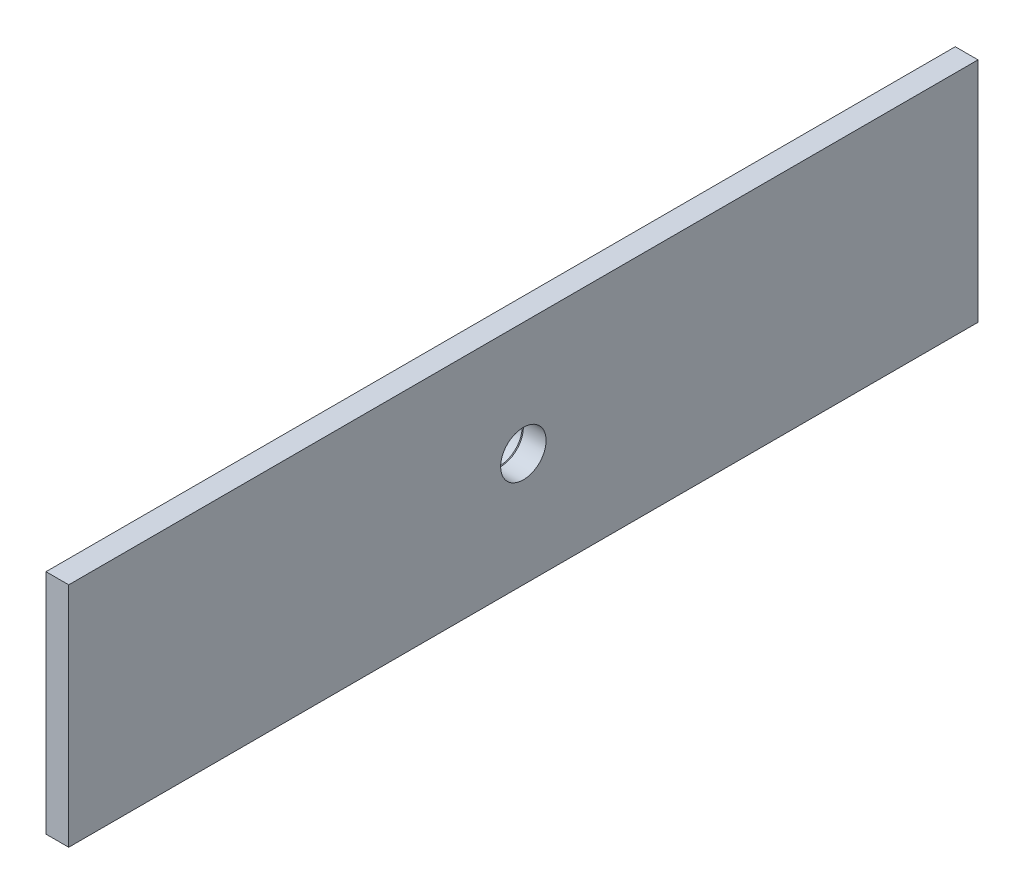
ISO-10303-21;
HEADER;
FILE_DESCRIPTION(('STEP AP214'),'2;1');
FILE_NAME('part.step','',(''),(''),'','','');
FILE_SCHEMA(('AUTOMOTIVE_DESIGN { 1 0 10303 214 1 1 1 1 }'));
ENDSEC;
DATA;
#1=APPLICATION_CONTEXT('core data for automotive mechanical design processes');
#2=APPLICATION_PROTOCOL_DEFINITION('international standard','automotive_design',2000,#1);
#3=PRODUCT_CONTEXT('',#1,'mechanical');
#4=PRODUCT('Part','Part','',(#3));
#5=PRODUCT_RELATED_PRODUCT_CATEGORY('part','',(#4));
#6=PRODUCT_DEFINITION_FORMATION('','',#4);
#7=PRODUCT_DEFINITION_CONTEXT('part definition',#1,'design');
#8=PRODUCT_DEFINITION('design','',#6,#7);
#9=PRODUCT_DEFINITION_SHAPE('','',#8);
#10=(LENGTH_UNIT() NAMED_UNIT(*) SI_UNIT(.MILLI.,.METRE.));
#11=(NAMED_UNIT(*) PLANE_ANGLE_UNIT() SI_UNIT($,.RADIAN.));
#12=(NAMED_UNIT(*) SI_UNIT($,.STERADIAN.) SOLID_ANGLE_UNIT());
#13=UNCERTAINTY_MEASURE_WITH_UNIT(LENGTH_MEASURE(1.E-05),#10,'distance_accuracy_value','');
#14=(GEOMETRIC_REPRESENTATION_CONTEXT(3) GLOBAL_UNCERTAINTY_ASSIGNED_CONTEXT((#13)) GLOBAL_UNIT_ASSIGNED_CONTEXT((#10,
#11,#12)) REPRESENTATION_CONTEXT('',''));
#15=CARTESIAN_POINT('',(0.,0.,0.));
#16=DIRECTION('',(0.,0.,1.));
#17=DIRECTION('',(1.,0.,0.));
#18=AXIS2_PLACEMENT_3D('',#15,#16,#17);
#19=CARTESIAN_POINT('',(528.,0.,889.100000000003));
#20=DIRECTION('',(1.,0.,0.));
#21=DIRECTION('',(0.,1.,0.));
#22=AXIS2_PLACEMENT_3D('',#19,#20,#21);
#23=CYLINDRICAL_SURFACE('',#22,20.);
#24=CARTESIAN_POINT('',(532.133974596216,0.,889.100000000003));
#25=DIRECTION('',(1.,0.,0.));
#26=DIRECTION('',(0.,1.,0.));
#27=AXIS2_PLACEMENT_3D('',#24,#25,#26);
#28=CIRCLE('',#27,20.);
#29=CARTESIAN_POINT('',(532.133974596216,19.9999999999999,889.100000000003));
#30=VERTEX_POINT('',#29);
#31=EDGE_CURVE('P0_E238',#30,#30,#28,.F.);
#32=ORIENTED_EDGE('',*,*,#31,.T.);
#33=EDGE_LOOP('',(#32));
#34=FACE_BOUND('',#33,.T.);
#35=CARTESIAN_POINT('',(528.5,0.,889.1));
#36=DIRECTION('',(1.,0.,0.));
#37=DIRECTION('',(0.,0.,-1.));
#38=AXIS2_PLACEMENT_3D('',#35,#36,#37);
#39=CIRCLE('',#38,20.);
#40=CARTESIAN_POINT('',(528.5,-0.499999999999685,909.093749023132));
#41=VERTEX_POINT('',#40);
#42=CARTESIAN_POINT('',(528.5,0.500000000000318,909.093749023132));
#43=VERTEX_POINT('',#42);
#44=EDGE_CURVE('P0_E190',#41,#43,#39,.F.);
#45=ORIENTED_EDGE('',*,*,#44,.T.);
#46=DIRECTION('',(1.,0.,0.));
#47=VECTOR('',#46,1.);
#48=CARTESIAN_POINT('',(532.84565955403,0.500000000000321,909.093749023132));
#49=LINE('',#48,#47);
#50=CARTESIAN_POINT('',(530.5,0.500000000000315,909.093749023135));
#51=VERTEX_POINT('',#50);
#52=EDGE_CURVE('P0_E216',#43,#51,#49,.T.);
#53=ORIENTED_EDGE('',*,*,#52,.T.);
#54=CARTESIAN_POINT('',(530.5,0.,889.1));
#55=DIRECTION('',(1.,0.,0.));
#56=DIRECTION('',(0.,0.,-1.));
#57=AXIS2_PLACEMENT_3D('',#54,#55,#56);
#58=CIRCLE('',#57,20.);
#59=CARTESIAN_POINT('',(530.5,-0.499999999999682,909.093749023132));
#60=VERTEX_POINT('',#59);
#61=EDGE_CURVE('P0_E60',#51,#60,#58,.T.);
#62=ORIENTED_EDGE('',*,*,#61,.T.);
#63=DIRECTION('',(1.,0.,0.));
#64=VECTOR('',#63,1.);
#65=CARTESIAN_POINT('',(532.84565955403,-0.499999999999683,909.093749023132));
#66=LINE('',#65,#64);
#67=EDGE_CURVE('P0_E208',#60,#41,#66,.F.);
#68=ORIENTED_EDGE('',*,*,#67,.T.);
#69=EDGE_LOOP('',(#45,#53,#62,#68));
#70=FACE_BOUND('',#69,.T.);
#71=CARTESIAN_POINT('',(528.,0.,889.100000000003));
#72=DIRECTION('',(1.,0.,0.));
#73=DIRECTION('',(0.,1.,0.));
#74=AXIS2_PLACEMENT_3D('',#71,#72,#73);
#75=CIRCLE('',#74,20.);
#76=CARTESIAN_POINT('',(528.,19.9999999999999,889.100000000003));
#77=VERTEX_POINT('',#76);
#78=EDGE_CURVE('P0_E195',#77,#77,#75,.T.);
#79=ORIENTED_EDGE('',*,*,#78,.T.);
#80=EDGE_LOOP('',(#79));
#81=FACE_BOUND('',#80,.T.);
#82=ADVANCED_FACE('P0_F43',(#34,#70,#81),#23,.T.);
#83=CARTESIAN_POINT('',(528.,19.9999999999999,889.100000000003));
#84=DIRECTION('',(-1.,0.,0.));
#85=DIRECTION('',(0.,-1.,0.));
#86=AXIS2_PLACEMENT_3D('',#83,#84,#85);
#87=PLANE('',#86);
#88=CARTESIAN_POINT('',(528.,11.1369318036882,900.236931803688));
#89=DIRECTION('',(-1.,0.,0.));
#90=DIRECTION('',(0.,0.,1.));
#91=AXIS2_PLACEMENT_3D('',#88,#89,#90);
#92=CIRCLE('',#91,2.09999999999998);
#93=CARTESIAN_POINT('',(528.,11.1369318036882,902.336931803688));
#94=VERTEX_POINT('',#93);
#95=EDGE_CURVE('P0_E140',#94,#94,#92,.T.);
#96=ORIENTED_EDGE('',*,*,#95,.F.);
#97=EDGE_LOOP('',(#96));
#98=FACE_BOUND('',#97,.T.);
#99=CARTESIAN_POINT('',(528.,-11.1369318036883,877.963068196312));
#100=DIRECTION('',(-1.,0.,0.));
#101=DIRECTION('',(0.,0.,1.));
#102=AXIS2_PLACEMENT_3D('',#99,#100,#101);
#103=CIRCLE('',#102,2.09999999999998);
#104=CARTESIAN_POINT('',(528.,-11.1369318036883,880.063068196312));
#105=VERTEX_POINT('',#104);
#106=EDGE_CURVE('P0_E154',#105,#105,#103,.T.);
#107=ORIENTED_EDGE('',*,*,#106,.F.);
#108=EDGE_LOOP('',(#107));
#109=FACE_BOUND('',#108,.T.);
#110=CARTESIAN_POINT('',(528.,11.136931803688,877.963068196312));
#111=DIRECTION('',(-1.,0.,0.));
#112=DIRECTION('',(0.,0.,1.));
#113=AXIS2_PLACEMENT_3D('',#110,#111,#112);
#114=CIRCLE('',#113,2.09999999999998);
#115=CARTESIAN_POINT('',(528.,11.136931803688,880.063068196312));
#116=VERTEX_POINT('',#115);
#117=EDGE_CURVE('P0_E162',#116,#116,#114,.T.);
#118=ORIENTED_EDGE('',*,*,#117,.F.);
#119=EDGE_LOOP('',(#118));
#120=FACE_BOUND('',#119,.T.);
#121=CARTESIAN_POINT('',(528.,-11.1369318036881,900.236931803688));
#122=DIRECTION('',(-1.,0.,0.));
#123=DIRECTION('',(0.,0.,1.));
#124=AXIS2_PLACEMENT_3D('',#121,#122,#123);
#125=CIRCLE('',#124,2.09999999999998);
#126=CARTESIAN_POINT('',(528.,-11.1369318036881,902.336931803688));
#127=VERTEX_POINT('',#126);
#128=EDGE_CURVE('P0_E170',#127,#127,#125,.T.);
#129=ORIENTED_EDGE('',*,*,#128,.F.);
#130=EDGE_LOOP('',(#129));
#131=FACE_BOUND('',#130,.T.);
#132=CARTESIAN_POINT('',(528.,2.36479859168099E-13,904.85));
#133=DIRECTION('',(-1.,0.,0.));
#134=DIRECTION('',(0.,0.,1.));
#135=AXIS2_PLACEMENT_3D('',#132,#133,#134);
#136=CIRCLE('',#135,2.49999999999993);
#137=CARTESIAN_POINT('',(528.,2.36479859168099E-13,907.35));
#138=VERTEX_POINT('',#137);
#139=EDGE_CURVE('P0_E178',#138,#138,#136,.T.);
#140=ORIENTED_EDGE('',*,*,#139,.F.);
#141=EDGE_LOOP('',(#140));
#142=FACE_BOUND('',#141,.T.);
#143=CARTESIAN_POINT('',(528.,0.,889.1));
#144=DIRECTION('',(1.,0.,0.));
#145=DIRECTION('',(0.,0.,-1.));
#146=AXIS2_PLACEMENT_3D('',#143,#144,#145);
#147=CIRCLE('',#146,10.);
#148=CARTESIAN_POINT('',(528.,0.,879.1));
#149=VERTEX_POINT('',#148);
#150=EDGE_CURVE('P0_E186',#149,#149,#147,.T.);
#151=ORIENTED_EDGE('',*,*,#150,.T.);
#152=EDGE_LOOP('',(#151));
#153=FACE_BOUND('',#152,.T.);
#154=ORIENTED_EDGE('',*,*,#78,.F.);
#155=EDGE_LOOP('',(#154));
#156=FACE_BOUND('',#155,.T.);
#157=ADVANCED_FACE('P0_F264',(#98,#109,#120,#131,#142,#153,#156),#87,.T.);
#158=CARTESIAN_POINT('',(528.5,-0.499999999999685,909.101000000003));
#159=DIRECTION('',(-1.,0.,0.));
#160=DIRECTION('',(0.,0.,1.));
#161=AXIS2_PLACEMENT_3D('',#158,#159,#160);
#162=PLANE('',#161);
#163=ORIENTED_EDGE('',*,*,#44,.F.);
#164=DIRECTION('',(0.,0.,-1.));
#165=VECTOR('',#164,1.);
#166=CARTESIAN_POINT('',(528.5,-0.499999999999685,909.101000000003));
#167=LINE('',#166,#165);
#168=CARTESIAN_POINT('',(528.5,-0.499999999999689,908.9));
#169=VERTEX_POINT('',#168);
#170=EDGE_CURVE('P0_E212',#41,#169,#167,.T.);
#171=ORIENTED_EDGE('',*,*,#170,.T.);
#172=DIRECTION('',(0.,1.,0.));
#173=VECTOR('',#172,1.);
#174=CARTESIAN_POINT('',(528.5,-0.499999999999689,908.9));
#175=LINE('',#174,#173);
#176=CARTESIAN_POINT('',(528.5,0.500000000000311,908.9));
#177=VERTEX_POINT('',#176);
#178=EDGE_CURVE('P0_E204',#169,#177,#175,.T.);
#179=ORIENTED_EDGE('',*,*,#178,.T.);
#180=DIRECTION('',(0.,0.,-1.));
#181=VECTOR('',#180,1.);
#182=CARTESIAN_POINT('',(528.5,0.500000000000315,909.101000000003));
#183=LINE('',#182,#181);
#184=EDGE_CURVE('P0_E68',#43,#177,#183,.T.);
#185=ORIENTED_EDGE('',*,*,#184,.F.);
#186=EDGE_LOOP('',(#163,#171,#179,#185));
#187=FACE_BOUND('',#186,.T.);
#188=ADVANCED_FACE('P0_F270',(#187),#162,.F.);
#189=CARTESIAN_POINT('',(530.5,-0.499999999999682,909.101000000003));
#190=DIRECTION('',(0.,-1.,0.));
#191=DIRECTION('',(0.,0.,-1.));
#192=AXIS2_PLACEMENT_3D('',#189,#190,#191);
#193=PLANE('',#192);
#194=ORIENTED_EDGE('',*,*,#67,.F.);
#195=DIRECTION('',(0.,0.,-1.));
#196=VECTOR('',#195,1.);
#197=CARTESIAN_POINT('',(530.5,-0.499999999999682,909.101000000003));
#198=LINE('',#197,#196);
#199=CARTESIAN_POINT('',(530.5,-0.499999999999686,908.9));
#200=VERTEX_POINT('',#199);
#201=EDGE_CURVE('P0_E220',#60,#200,#198,.T.);
#202=ORIENTED_EDGE('',*,*,#201,.T.);
#203=DIRECTION('',(-1.,0.,0.));
#204=VECTOR('',#203,1.);
#205=CARTESIAN_POINT('',(530.5,-0.499999999999686,908.9));
#206=LINE('',#205,#204);
#207=EDGE_CURVE('P0_E191',#200,#169,#206,.T.);
#208=ORIENTED_EDGE('',*,*,#207,.T.);
#209=ORIENTED_EDGE('',*,*,#170,.F.);
#210=EDGE_LOOP('',(#194,#202,#208,#209));
#211=FACE_BOUND('',#210,.T.);
#212=ADVANCED_FACE('P0_F282',(#211),#193,.F.);
#213=CARTESIAN_POINT('',(530.5,0.500000000000314,909.101000000003));
#214=DIRECTION('',(1.,0.,0.));
#215=DIRECTION('',(0.,0.,-1.));
#216=AXIS2_PLACEMENT_3D('',#213,#214,#215);
#217=PLANE('',#216);
#218=ORIENTED_EDGE('',*,*,#61,.F.);
#219=DIRECTION('',(0.,0.,-1.));
#220=VECTOR('',#219,1.);
#221=CARTESIAN_POINT('',(530.5,0.500000000000314,909.101000000003));
#222=LINE('',#221,#220);
#223=CARTESIAN_POINT('',(530.5,0.500000000000311,908.9));
#224=VERTEX_POINT('',#223);
#225=EDGE_CURVE('P0_E207',#51,#224,#222,.T.);
#226=ORIENTED_EDGE('',*,*,#225,.T.);
#227=DIRECTION('',(0.,-1.,0.));
#228=VECTOR('',#227,1.);
#229=CARTESIAN_POINT('',(530.5,0.500000000000311,908.9));
#230=LINE('',#229,#228);
#231=EDGE_CURVE('P0_E196',#224,#200,#230,.T.);
#232=ORIENTED_EDGE('',*,*,#231,.T.);
#233=ORIENTED_EDGE('',*,*,#201,.F.);
#234=EDGE_LOOP('',(#218,#226,#232,#233));
#235=FACE_BOUND('',#234,.T.);
#236=ADVANCED_FACE('P0_F285',(#235),#217,.F.);
#237=CARTESIAN_POINT('',(528.5,0.500000000000315,909.101000000003));
#238=DIRECTION('',(0.,1.,0.));
#239=DIRECTION('',(0.,0.,1.));
#240=AXIS2_PLACEMENT_3D('',#237,#238,#239);
#241=PLANE('',#240);
#242=ORIENTED_EDGE('',*,*,#52,.F.);
#243=ORIENTED_EDGE('',*,*,#184,.T.);
#244=DIRECTION('',(1.,0.,0.));
#245=VECTOR('',#244,1.);
#246=CARTESIAN_POINT('',(528.5,0.500000000000311,908.9));
#247=LINE('',#246,#245);
#248=EDGE_CURVE('P0_E200',#177,#224,#247,.T.);
#249=ORIENTED_EDGE('',*,*,#248,.T.);
#250=ORIENTED_EDGE('',*,*,#225,.F.);
#251=EDGE_LOOP('',(#242,#243,#249,#250));
#252=FACE_BOUND('',#251,.T.);
#253=ADVANCED_FACE('P0_F289',(#252),#241,.F.);
#254=CARTESIAN_POINT('',(0.,0.,908.9));
#255=DIRECTION('',(0.,0.,-1.));
#256=DIRECTION('',(-1.,0.,0.));
#257=AXIS2_PLACEMENT_3D('',#254,#255,#256);
#258=PLANE('',#257);
#259=ORIENTED_EDGE('',*,*,#178,.F.);
#260=ORIENTED_EDGE('',*,*,#207,.F.);
#261=ORIENTED_EDGE('',*,*,#231,.F.);
#262=ORIENTED_EDGE('',*,*,#248,.F.);
#263=EDGE_LOOP('',(#259,#260,#261,#262));
#264=FACE_BOUND('',#263,.T.);
#265=ADVANCED_FACE('P0_F292',(#264),#258,.F.);
#266=CARTESIAN_POINT('',(533.,0.,889.1));
#267=DIRECTION('',(1.,0.,0.));
#268=DIRECTION('',(0.,0.,-1.));
#269=AXIS2_PLACEMENT_3D('',#266,#267,#268);
#270=CYLINDRICAL_SURFACE('',#269,10.);
#271=CARTESIAN_POINT('',(532.5,0.,889.1));
#272=DIRECTION('',(1.,0.,0.));
#273=DIRECTION('',(0.,0.,-1.));
#274=AXIS2_PLACEMENT_3D('',#271,#272,#273);
#275=CIRCLE('',#274,10.);
#276=CARTESIAN_POINT('',(532.5,0.,879.1));
#277=VERTEX_POINT('',#276);
#278=EDGE_CURVE('P0_E53',#277,#277,#275,.T.);
#279=ORIENTED_EDGE('',*,*,#278,.T.);
#280=EDGE_LOOP('',(#279));
#281=FACE_BOUND('',#280,.T.);
#282=ORIENTED_EDGE('',*,*,#150,.F.);
#283=EDGE_LOOP('',(#282));
#284=FACE_BOUND('',#283,.T.);
#285=ADVANCED_FACE('P0_F245',(#281,#284),#270,.F.);
#286=CARTESIAN_POINT('',(528.,2.36479859168099E-13,904.85));
#287=DIRECTION('',(-1.,0.,0.));
#288=DIRECTION('',(0.,0.,1.));
#289=AXIS2_PLACEMENT_3D('',#286,#287,#288);
#290=CYLINDRICAL_SURFACE('',#289,2.49999999999993);
#291=CARTESIAN_POINT('',(533.,2.36479859168099E-13,904.85));
#292=DIRECTION('',(-1.,0.,0.));
#293=DIRECTION('',(0.,0.,1.));
#294=AXIS2_PLACEMENT_3D('',#291,#292,#293);
#295=CIRCLE('',#294,2.49999999999993);
#296=CARTESIAN_POINT('',(533.,2.36479859168099E-13,907.35));
#297=VERTEX_POINT('',#296);
#298=EDGE_CURVE('P0_E182',#297,#297,#295,.T.);
#299=ORIENTED_EDGE('',*,*,#298,.F.);
#300=EDGE_LOOP('',(#299));
#301=FACE_BOUND('',#300,.T.);
#302=ORIENTED_EDGE('',*,*,#139,.T.);
#303=EDGE_LOOP('',(#302));
#304=FACE_BOUND('',#303,.T.);
#305=ADVANCED_FACE('P0_F299',(#301,#304),#290,.F.);
#306=CARTESIAN_POINT('',(528.,-11.1369318036881,900.236931803688));
#307=DIRECTION('',(-1.,0.,0.));
#308=DIRECTION('',(0.,0.,1.));
#309=AXIS2_PLACEMENT_3D('',#306,#307,#308);
#310=CYLINDRICAL_SURFACE('',#309,2.09999999999998);
#311=CARTESIAN_POINT('',(533.,-11.1369318036881,900.236931803688));
#312=DIRECTION('',(-1.,0.,0.));
#313=DIRECTION('',(0.,0.,1.));
#314=AXIS2_PLACEMENT_3D('',#311,#312,#313);
#315=CIRCLE('',#314,2.09999999999998);
#316=CARTESIAN_POINT('',(533.,-11.1369318036881,902.336931803688));
#317=VERTEX_POINT('',#316);
#318=EDGE_CURVE('P0_E174',#317,#317,#315,.T.);
#319=ORIENTED_EDGE('',*,*,#318,.F.);
#320=EDGE_LOOP('',(#319));
#321=FACE_BOUND('',#320,.T.);
#322=ORIENTED_EDGE('',*,*,#128,.T.);
#323=EDGE_LOOP('',(#322));
#324=FACE_BOUND('',#323,.T.);
#325=ADVANCED_FACE('P0_F302',(#321,#324),#310,.F.);
#326=CARTESIAN_POINT('',(528.,11.136931803688,877.963068196312));
#327=DIRECTION('',(-1.,0.,0.));
#328=DIRECTION('',(0.,0.,1.));
#329=AXIS2_PLACEMENT_3D('',#326,#327,#328);
#330=CYLINDRICAL_SURFACE('',#329,2.09999999999998);
#331=CARTESIAN_POINT('',(533.,11.136931803688,877.963068196312));
#332=DIRECTION('',(-1.,0.,0.));
#333=DIRECTION('',(0.,0.,1.));
#334=AXIS2_PLACEMENT_3D('',#331,#332,#333);
#335=CIRCLE('',#334,2.09999999999998);
#336=CARTESIAN_POINT('',(533.,11.136931803688,880.063068196312));
#337=VERTEX_POINT('',#336);
#338=EDGE_CURVE('P0_E166',#337,#337,#335,.T.);
#339=ORIENTED_EDGE('',*,*,#338,.F.);
#340=EDGE_LOOP('',(#339));
#341=FACE_BOUND('',#340,.T.);
#342=ORIENTED_EDGE('',*,*,#117,.T.);
#343=EDGE_LOOP('',(#342));
#344=FACE_BOUND('',#343,.T.);
#345=ADVANCED_FACE('P0_F306',(#341,#344),#330,.F.);
#346=CARTESIAN_POINT('',(528.,-11.1369318036883,877.963068196312));
#347=DIRECTION('',(-1.,0.,0.));
#348=DIRECTION('',(0.,0.,1.));
#349=AXIS2_PLACEMENT_3D('',#346,#347,#348);
#350=CYLINDRICAL_SURFACE('',#349,2.09999999999998);
#351=CARTESIAN_POINT('',(533.,-11.1369318036883,877.963068196312));
#352=DIRECTION('',(-1.,0.,0.));
#353=DIRECTION('',(0.,0.,1.));
#354=AXIS2_PLACEMENT_3D('',#351,#352,#353);
#355=CIRCLE('',#354,2.09999999999998);
#356=CARTESIAN_POINT('',(533.,-11.1369318036883,880.063068196312));
#357=VERTEX_POINT('',#356);
#358=EDGE_CURVE('P0_E158',#357,#357,#355,.T.);
#359=ORIENTED_EDGE('',*,*,#358,.F.);
#360=EDGE_LOOP('',(#359));
#361=FACE_BOUND('',#360,.T.);
#362=ORIENTED_EDGE('',*,*,#106,.T.);
#363=EDGE_LOOP('',(#362));
#364=FACE_BOUND('',#363,.T.);
#365=ADVANCED_FACE('P0_F310',(#361,#364),#350,.F.);
#366=CARTESIAN_POINT('',(528.,11.1369318036882,900.236931803688));
#367=DIRECTION('',(-1.,0.,0.));
#368=DIRECTION('',(0.,0.,1.));
#369=AXIS2_PLACEMENT_3D('',#366,#367,#368);
#370=CYLINDRICAL_SURFACE('',#369,2.09999999999998);
#371=CARTESIAN_POINT('',(533.,11.1369318036882,900.236931803688));
#372=DIRECTION('',(-1.,0.,0.));
#373=DIRECTION('',(0.,0.,1.));
#374=AXIS2_PLACEMENT_3D('',#371,#372,#373);
#375=CIRCLE('',#374,2.09999999999998);
#376=CARTESIAN_POINT('',(533.,11.1369318036882,902.336931803688));
#377=VERTEX_POINT('',#376);
#378=EDGE_CURVE('P0_E145',#377,#377,#375,.T.);
#379=ORIENTED_EDGE('',*,*,#378,.F.);
#380=EDGE_LOOP('',(#379));
#381=FACE_BOUND('',#380,.T.);
#382=ORIENTED_EDGE('',*,*,#95,.T.);
#383=EDGE_LOOP('',(#382));
#384=FACE_BOUND('',#383,.T.);
#385=ADVANCED_FACE('P0_F260',(#381,#384),#370,.F.);
#386=CARTESIAN_POINT('',(533.,0.,889.100000000003));
#387=DIRECTION('',(-1.,0.,0.));
#388=DIRECTION('',(0.,-1.,0.));
#389=AXIS2_PLACEMENT_3D('',#386,#387,#388);
#390=CONICAL_SURFACE('',#389,19.5000000000001,0.523598775598266);
#391=ORIENTED_EDGE('',*,*,#31,.F.);
#392=EDGE_LOOP('',(#391));
#393=FACE_BOUND('',#392,.T.);
#394=CARTESIAN_POINT('',(533.,0.,889.100000000003));
#395=DIRECTION('',(1.,0.,0.));
#396=DIRECTION('',(0.,1.,0.));
#397=AXIS2_PLACEMENT_3D('',#394,#395,#396);
#398=CIRCLE('',#397,19.5000000000001);
#399=CARTESIAN_POINT('',(533.,19.5,889.100000000003));
#400=VERTEX_POINT('',#399);
#401=EDGE_CURVE('P0_E234',#400,#400,#398,.T.);
#402=ORIENTED_EDGE('',*,*,#401,.F.);
#403=EDGE_LOOP('',(#402));
#404=FACE_BOUND('',#403,.T.);
#405=ADVANCED_FACE('P0_F250',(#393,#404),#390,.T.);
#406=CARTESIAN_POINT('',(532.5,0.,889.1));
#407=DIRECTION('',(1.,0.,0.));
#408=DIRECTION('',(0.,0.,-1.));
#409=AXIS2_PLACEMENT_3D('',#406,#407,#408);
#410=CONICAL_SURFACE('',#409,10.,0.785398163397349);
#411=CARTESIAN_POINT('',(533.,0.,889.1));
#412=DIRECTION('',(1.,0.,0.));
#413=DIRECTION('',(0.,1.,0.));
#414=AXIS2_PLACEMENT_3D('',#411,#412,#413);
#415=CIRCLE('',#414,10.4999999999998);
#416=CARTESIAN_POINT('',(533.,10.4999999999998,889.1));
#417=VERTEX_POINT('',#416);
#418=EDGE_CURVE('P0_E11',#417,#417,#415,.F.);
#419=ORIENTED_EDGE('',*,*,#418,.F.);
#420=EDGE_LOOP('',(#419));
#421=FACE_BOUND('',#420,.T.);
#422=ORIENTED_EDGE('',*,*,#278,.F.);
#423=EDGE_LOOP('',(#422));
#424=FACE_BOUND('',#423,.T.);
#425=ADVANCED_FACE('P0_F46',(#421,#424),#410,.F.);
#426=CARTESIAN_POINT('',(533.,0.,0.));
#427=DIRECTION('',(1.,0.,0.));
#428=DIRECTION('',(0.,0.,-1.));
#429=AXIS2_PLACEMENT_3D('',#426,#427,#428);
#430=PLANE('',#429);
#431=ORIENTED_EDGE('',*,*,#298,.T.);
#432=EDGE_LOOP('',(#431));
#433=FACE_BOUND('',#432,.T.);
#434=ADVANCED_FACE('P0_F249',(#433),#430,.F.);
#435=ORIENTED_EDGE('',*,*,#318,.T.);
#436=EDGE_LOOP('',(#435));
#437=FACE_BOUND('',#436,.T.);
#438=ADVANCED_FACE('P0_F256',(#437),#430,.F.);
#439=ORIENTED_EDGE('',*,*,#338,.T.);
#440=EDGE_LOOP('',(#439));
#441=FACE_BOUND('',#440,.T.);
#442=ADVANCED_FACE('P0_F387',(#441),#430,.F.);
#443=ORIENTED_EDGE('',*,*,#358,.T.);
#444=EDGE_LOOP('',(#443));
#445=FACE_BOUND('',#444,.T.);
#446=ADVANCED_FACE('P0_F382',(#445),#430,.F.);
#447=ORIENTED_EDGE('',*,*,#378,.T.);
#448=EDGE_LOOP('',(#447));
#449=FACE_BOUND('',#448,.T.);
#450=ADVANCED_FACE('P0_F333',(#449),#430,.F.);
#451=CARTESIAN_POINT('',(533.,0.,889.1));
#452=DIRECTION('',(1.,0.,0.));
#453=DIRECTION('',(0.,1.,0.));
#454=AXIS2_PLACEMENT_3D('',#451,#452,#453);
#455=CIRCLE('',#454,9.99999999999998);
#456=CARTESIAN_POINT('',(533.,9.99999999999992,889.1));
#457=VERTEX_POINT('',#456);
#458=EDGE_CURVE('P0_E347',#457,#457,#455,.T.);
#459=ORIENTED_EDGE('',*,*,#458,.T.);
#460=EDGE_LOOP('',(#459));
#461=FACE_BOUND('',#460,.T.);
#462=ORIENTED_EDGE('',*,*,#418,.T.);
#463=EDGE_LOOP('',(#462));
#464=FACE_BOUND('',#463,.T.);
#465=ADVANCED_FACE('P0_F259',(#461,#464),#430,.F.);
#466=DIRECTION('',(0.,-1.,0.));
#467=VECTOR('',#466,1.);
#468=CARTESIAN_POINT('',(533.,49.9999999999999,1089.1));
#469=LINE('',#468,#467);
#470=CARTESIAN_POINT('',(533.,49.9999999999999,1089.1));
#471=VERTEX_POINT('',#470);
#472=CARTESIAN_POINT('',(533.,-50.0000000000001,1089.1));
#473=VERTEX_POINT('',#472);
#474=EDGE_CURVE('P0_E138',#471,#473,#469,.T.);
#475=ORIENTED_EDGE('',*,*,#474,.F.);
#476=DIRECTION('',(0.,0.,1.));
#477=VECTOR('',#476,1.);
#478=CARTESIAN_POINT('',(533.,49.9999999999999,1089.1));
#479=LINE('',#478,#477);
#480=CARTESIAN_POINT('',(533.,49.9999999999999,689.1));
#481=VERTEX_POINT('',#480);
#482=EDGE_CURVE('P0_E134',#481,#471,#479,.T.);
#483=ORIENTED_EDGE('',*,*,#482,.F.);
#484=DIRECTION('',(0.,1.,0.));
#485=VECTOR('',#484,1.);
#486=CARTESIAN_POINT('',(533.,49.9999999999999,689.1));
#487=LINE('',#486,#485);
#488=CARTESIAN_POINT('',(533.,-50.0000000000001,689.1));
#489=VERTEX_POINT('',#488);
#490=EDGE_CURVE('P0_E363',#489,#481,#487,.T.);
#491=ORIENTED_EDGE('',*,*,#490,.F.);
#492=DIRECTION('',(0.,0.,-1.));
#493=VECTOR('',#492,1.);
#494=CARTESIAN_POINT('',(533.,-50.0000000000001,1089.1));
#495=LINE('',#494,#493);
#496=EDGE_CURVE('P0_E360',#473,#489,#495,.T.);
#497=ORIENTED_EDGE('',*,*,#496,.F.);
#498=EDGE_LOOP('',(#475,#483,#491,#497));
#499=FACE_BOUND('',#498,.T.);
#500=ORIENTED_EDGE('',*,*,#401,.T.);
#501=EDGE_LOOP('',(#500));
#502=FACE_BOUND('',#501,.T.);
#503=ADVANCED_FACE('P0_F332',(#499,#502),#430,.F.);
#504=CARTESIAN_POINT('',(543.,0.,0.));
#505=DIRECTION('',(1.,0.,0.));
#506=DIRECTION('',(0.,0.,-1.));
#507=AXIS2_PLACEMENT_3D('',#504,#505,#506);
#508=PLANE('',#507);
#509=DIRECTION('',(0.,-1.,0.));
#510=VECTOR('',#509,1.);
#511=CARTESIAN_POINT('',(543.,49.9999999999999,1089.1));
#512=LINE('',#511,#510);
#513=CARTESIAN_POINT('',(543.,49.9999999999999,1089.1));
#514=VERTEX_POINT('',#513);
#515=CARTESIAN_POINT('',(543.,-50.0000000000001,1089.1));
#516=VERTEX_POINT('',#515);
#517=EDGE_CURVE('P0_E123',#514,#516,#512,.T.);
#518=ORIENTED_EDGE('',*,*,#517,.T.);
#519=DIRECTION('',(0.,0.,-1.));
#520=VECTOR('',#519,1.);
#521=CARTESIAN_POINT('',(543.,-50.0000000000001,1089.1));
#522=LINE('',#521,#520);
#523=CARTESIAN_POINT('',(543.,-50.0000000000001,689.1));
#524=VERTEX_POINT('',#523);
#525=EDGE_CURVE('P0_E111',#516,#524,#522,.T.);
#526=ORIENTED_EDGE('',*,*,#525,.T.);
#527=DIRECTION('',(0.,1.,0.));
#528=VECTOR('',#527,1.);
#529=CARTESIAN_POINT('',(543.,49.9999999999999,689.1));
#530=LINE('',#529,#528);
#531=CARTESIAN_POINT('',(543.,49.9999999999999,689.1));
#532=VERTEX_POINT('',#531);
#533=EDGE_CURVE('P0_E122',#524,#532,#530,.T.);
#534=ORIENTED_EDGE('',*,*,#533,.T.);
#535=DIRECTION('',(0.,0.,1.));
#536=VECTOR('',#535,1.);
#537=CARTESIAN_POINT('',(543.,49.9999999999999,1089.1));
#538=LINE('',#537,#536);
#539=EDGE_CURVE('P0_E129',#532,#514,#538,.T.);
#540=ORIENTED_EDGE('',*,*,#539,.T.);
#541=EDGE_LOOP('',(#518,#526,#534,#540));
#542=FACE_BOUND('',#541,.T.);
#543=CARTESIAN_POINT('',(543.,0.,889.1));
#544=DIRECTION('',(1.,0.,0.));
#545=DIRECTION('',(0.,1.,0.));
#546=AXIS2_PLACEMENT_3D('',#543,#544,#545);
#547=CIRCLE('',#546,9.99999999999998);
#548=CARTESIAN_POINT('',(543.,9.99999999999992,889.1));
#549=VERTEX_POINT('',#548);
#550=EDGE_CURVE('P0_E344',#549,#549,#547,.T.);
#551=ORIENTED_EDGE('',*,*,#550,.F.);
#552=EDGE_LOOP('',(#551));
#553=FACE_BOUND('',#552,.T.);
#554=ADVANCED_FACE('P0_F126',(#542,#553),#508,.T.);
#555=CARTESIAN_POINT('',(543.,49.9999999999999,1089.1));
#556=DIRECTION('',(0.,0.,-1.));
#557=DIRECTION('',(-1.,0.,0.));
#558=AXIS2_PLACEMENT_3D('',#555,#556,#557);
#559=PLANE('',#558);
#560=ORIENTED_EDGE('',*,*,#474,.T.);
#561=DIRECTION('',(-1.,0.,0.));
#562=VECTOR('',#561,1.);
#563=CARTESIAN_POINT('',(543.,-50.0000000000001,1089.1));
#564=LINE('',#563,#562);
#565=EDGE_CURVE('P0_E115',#516,#473,#564,.T.);
#566=ORIENTED_EDGE('',*,*,#565,.F.);
#567=ORIENTED_EDGE('',*,*,#517,.F.);
#568=DIRECTION('',(-1.,0.,0.));
#569=VECTOR('',#568,1.);
#570=CARTESIAN_POINT('',(543.,49.9999999999999,1089.1));
#571=LINE('',#570,#569);
#572=EDGE_CURVE('P0_E357',#514,#471,#571,.T.);
#573=ORIENTED_EDGE('',*,*,#572,.T.);
#574=EDGE_LOOP('',(#560,#566,#567,#573));
#575=FACE_BOUND('',#574,.T.);
#576=ADVANCED_FACE('P0_F136',(#575),#559,.F.);
#577=CARTESIAN_POINT('',(543.,-50.0000000000001,1089.1));
#578=DIRECTION('',(0.,1.,0.));
#579=DIRECTION('',(-1.,0.,0.));
#580=AXIS2_PLACEMENT_3D('',#577,#578,#579);
#581=PLANE('',#580);
#582=ORIENTED_EDGE('',*,*,#496,.T.);
#583=DIRECTION('',(-1.,0.,0.));
#584=VECTOR('',#583,1.);
#585=CARTESIAN_POINT('',(543.,-50.0000000000001,689.1));
#586=LINE('',#585,#584);
#587=EDGE_CURVE('P0_E118',#524,#489,#586,.T.);
#588=ORIENTED_EDGE('',*,*,#587,.F.);
#589=ORIENTED_EDGE('',*,*,#525,.F.);
#590=ORIENTED_EDGE('',*,*,#565,.T.);
#591=EDGE_LOOP('',(#582,#588,#589,#590));
#592=FACE_BOUND('',#591,.T.);
#593=ADVANCED_FACE('P0_F113',(#592),#581,.F.);
#594=CARTESIAN_POINT('',(543.,49.9999999999999,689.1));
#595=DIRECTION('',(0.,0.,1.));
#596=DIRECTION('',(1.,0.,0.));
#597=AXIS2_PLACEMENT_3D('',#594,#595,#596);
#598=PLANE('',#597);
#599=ORIENTED_EDGE('',*,*,#490,.T.);
#600=DIRECTION('',(-1.,0.,0.));
#601=VECTOR('',#600,1.);
#602=CARTESIAN_POINT('',(543.,49.9999999999999,689.1));
#603=LINE('',#602,#601);
#604=EDGE_CURVE('P0_E147',#532,#481,#603,.T.);
#605=ORIENTED_EDGE('',*,*,#604,.F.);
#606=ORIENTED_EDGE('',*,*,#533,.F.);
#607=ORIENTED_EDGE('',*,*,#587,.T.);
#608=EDGE_LOOP('',(#599,#605,#606,#607));
#609=FACE_BOUND('',#608,.T.);
#610=ADVANCED_FACE('P0_F322',(#609),#598,.F.);
#611=CARTESIAN_POINT('',(543.,49.9999999999999,1089.1));
#612=DIRECTION('',(0.,-1.,0.));
#613=DIRECTION('',(1.,0.,0.));
#614=AXIS2_PLACEMENT_3D('',#611,#612,#613);
#615=PLANE('',#614);
#616=ORIENTED_EDGE('',*,*,#482,.T.);
#617=ORIENTED_EDGE('',*,*,#572,.F.);
#618=ORIENTED_EDGE('',*,*,#539,.F.);
#619=ORIENTED_EDGE('',*,*,#604,.T.);
#620=EDGE_LOOP('',(#616,#617,#618,#619));
#621=FACE_BOUND('',#620,.T.);
#622=ADVANCED_FACE('P0_F325',(#621),#615,.F.);
#623=CARTESIAN_POINT('',(543.,0.,889.1));
#624=DIRECTION('',(-1.,0.,0.));
#625=DIRECTION('',(0.,-1.,0.));
#626=AXIS2_PLACEMENT_3D('',#623,#624,#625);
#627=CYLINDRICAL_SURFACE('',#626,9.99999999999998);
#628=ORIENTED_EDGE('',*,*,#550,.T.);
#629=EDGE_LOOP('',(#628));
#630=FACE_BOUND('',#629,.T.);
#631=ORIENTED_EDGE('',*,*,#458,.F.);
#632=EDGE_LOOP('',(#631));
#633=FACE_BOUND('',#632,.T.);
#634=ADVANCED_FACE('P0_F328',(#630,#633),#627,.F.);
#635=CLOSED_SHELL('',(#82,#157,#188,#212,#236,#253,#265,#285,#305,#325,#345,#365,#385,#405,#425,
#434,#438,#442,#446,#450,#465,#503,#554,#576,#593,#610,#622,#634));
#636=MANIFOLD_SOLID_BREP('P0_B2',#635);
#637=CARTESIAN_POINT('',(532.84565955403,0.,889.1));
#638=DIRECTION('',(1.,0.,0.));
#639=DIRECTION('',(0.,0.,-1.));
#640=AXIS2_PLACEMENT_3D('',#637,#638,#639);
#641=CYLINDRICAL_SURFACE('',#640,20.);
#642=CARTESIAN_POINT('',(530.5,0.,889.1));
#643=DIRECTION('',(1.,0.,0.));
#644=DIRECTION('',(0.,0.,-1.));
#645=AXIS2_PLACEMENT_3D('',#642,#643,#644);
#646=CIRCLE('',#645,20.);
#647=CARTESIAN_POINT('',(530.5,0.500000000000318,909.093749023132));
#648=VERTEX_POINT('',#647);
#649=CARTESIAN_POINT('',(530.5,-0.499999999999684,909.093749023132));
#650=VERTEX_POINT('',#649);
#651=EDGE_CURVE('P1_E26',#648,#650,#646,.T.);
#652=ORIENTED_EDGE('',*,*,#651,.F.);
#653=DIRECTION('',(1.,0.,0.));
#654=VECTOR('',#653,1.);
#655=CARTESIAN_POINT('',(532.84565955403,0.500000000000321,909.093749023132));
#656=LINE('',#655,#654);
#657=CARTESIAN_POINT('',(528.5,0.500000000000318,909.093749023132));
#658=VERTEX_POINT('',#657);
#659=EDGE_CURVE('P1_E37',#658,#648,#656,.T.);
#660=ORIENTED_EDGE('',*,*,#659,.F.);
#661=CARTESIAN_POINT('',(528.5,0.,889.1));
#662=DIRECTION('',(1.,0.,0.));
#663=DIRECTION('',(0.,0.,-1.));
#664=AXIS2_PLACEMENT_3D('',#661,#662,#663);
#665=CIRCLE('',#664,20.);
#666=CARTESIAN_POINT('',(528.5,-0.499999999999685,909.093749023132));
#667=VERTEX_POINT('',#666);
#668=EDGE_CURVE('P1_E22',#667,#658,#665,.F.);
#669=ORIENTED_EDGE('',*,*,#668,.F.);
#670=DIRECTION('',(1.,0.,0.));
#671=VECTOR('',#670,1.);
#672=CARTESIAN_POINT('',(532.84565955403,-0.499999999999683,909.093749023132));
#673=LINE('',#672,#671);
#674=EDGE_CURVE('P1_E11',#650,#667,#673,.F.);
#675=ORIENTED_EDGE('',*,*,#674,.F.);
#676=EDGE_LOOP('',(#652,#660,#669,#675));
#677=FACE_BOUND('',#676,.T.);
#678=ADVANCED_FACE('P1_F17',(#677),#641,.T.);
#679=OPEN_SHELL('',(#678));
#680=SHELL_BASED_SURFACE_MODEL('P1_B1',(#679));
#681=ADVANCED_BREP_SHAPE_REPRESENTATION('',(#18,#636),#14);
#682=MANIFOLD_SURFACE_SHAPE_REPRESENTATION('',(#18,#680),#14);
#683=SHAPE_REPRESENTATION('',(#18),#14);
#684=SHAPE_DEFINITION_REPRESENTATION(#9,#683);
#685=SHAPE_REPRESENTATION_RELATIONSHIP('','',#683,#681);
#686=SHAPE_REPRESENTATION_RELATIONSHIP('','',#683,#682);
ENDSEC;
END-ISO-10303-21;
